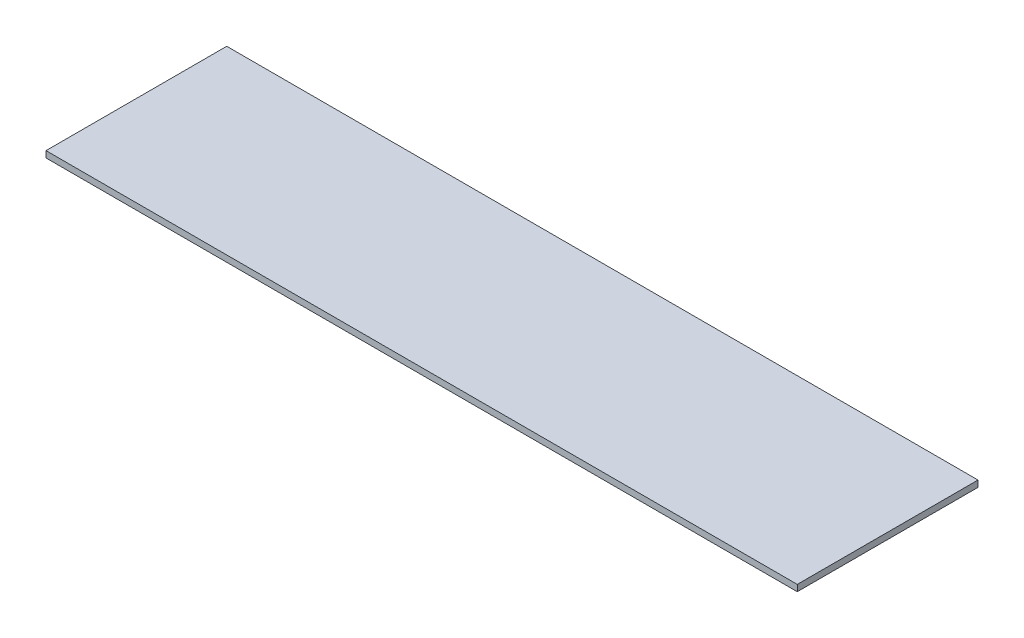
ISO-10303-21;
HEADER;
FILE_DESCRIPTION(('STEP AP214'),'2;1');
FILE_NAME('part.step','',(''),(''),'','','');
FILE_SCHEMA(('AUTOMOTIVE_DESIGN { 1 0 10303 214 1 1 1 1 }'));
ENDSEC;
DATA;
#1=APPLICATION_CONTEXT('core data for automotive mechanical design processes');
#2=APPLICATION_PROTOCOL_DEFINITION('international standard','automotive_design',2000,#1);
#3=PRODUCT_CONTEXT('',#1,'mechanical');
#4=PRODUCT('Part','Part','',(#3));
#5=PRODUCT_RELATED_PRODUCT_CATEGORY('part','',(#4));
#6=PRODUCT_DEFINITION_FORMATION('','',#4);
#7=PRODUCT_DEFINITION_CONTEXT('part definition',#1,'design');
#8=PRODUCT_DEFINITION('design','',#6,#7);
#9=PRODUCT_DEFINITION_SHAPE('','',#8);
#10=(LENGTH_UNIT() NAMED_UNIT(*) SI_UNIT(.MILLI.,.METRE.));
#11=(NAMED_UNIT(*) PLANE_ANGLE_UNIT() SI_UNIT($,.RADIAN.));
#12=(NAMED_UNIT(*) SI_UNIT($,.STERADIAN.) SOLID_ANGLE_UNIT());
#13=UNCERTAINTY_MEASURE_WITH_UNIT(LENGTH_MEASURE(1.E-05),#10,'distance_accuracy_value','');
#14=(GEOMETRIC_REPRESENTATION_CONTEXT(3) GLOBAL_UNCERTAINTY_ASSIGNED_CONTEXT((#13)) GLOBAL_UNIT_ASSIGNED_CONTEXT((#10,
#11,#12)) REPRESENTATION_CONTEXT('',''));
#15=CARTESIAN_POINT('',(0.,0.,0.));
#16=DIRECTION('',(0.,0.,1.));
#17=DIRECTION('',(1.,0.,0.));
#18=AXIS2_PLACEMENT_3D('',#15,#16,#17);
#19=CARTESIAN_POINT('',(0.,18.,0.));
#20=DIRECTION('',(1.,0.,0.));
#21=DIRECTION('',(0.,0.,-1.));
#22=AXIS2_PLACEMENT_3D('',#19,#20,#21);
#23=PLANE('',#22);
#24=DIRECTION('',(0.,0.,1.));
#25=VECTOR('',#24,1.);
#26=CARTESIAN_POINT('',(0.,0.,0.));
#27=LINE('',#26,#25);
#28=CARTESIAN_POINT('',(0.,0.,-510.));
#29=VERTEX_POINT('',#28);
#30=CARTESIAN_POINT('',(0.,0.,0.));
#31=VERTEX_POINT('',#30);
#32=EDGE_CURVE('E96',#29,#31,#27,.T.);
#33=ORIENTED_EDGE('',*,*,#32,.T.);
#34=DIRECTION('',(0.,-1.,0.));
#35=VECTOR('',#34,1.);
#36=CARTESIAN_POINT('',(0.,18.,0.));
#37=LINE('',#36,#35);
#38=CARTESIAN_POINT('',(0.,18.,0.));
#39=VERTEX_POINT('',#38);
#40=EDGE_CURVE('E11',#39,#31,#37,.T.);
#41=ORIENTED_EDGE('',*,*,#40,.F.);
#42=DIRECTION('',(0.,0.,1.));
#43=VECTOR('',#42,1.);
#44=CARTESIAN_POINT('',(0.,18.,0.));
#45=LINE('',#44,#43);
#46=CARTESIAN_POINT('',(0.,18.,-510.));
#47=VERTEX_POINT('',#46);
#48=EDGE_CURVE('E84',#47,#39,#45,.T.);
#49=ORIENTED_EDGE('',*,*,#48,.F.);
#50=DIRECTION('',(0.,-1.,0.));
#51=VECTOR('',#50,1.);
#52=CARTESIAN_POINT('',(0.,18.,-510.));
#53=LINE('',#52,#51);
#54=EDGE_CURVE('E92',#47,#29,#53,.T.);
#55=ORIENTED_EDGE('',*,*,#54,.T.);
#56=EDGE_LOOP('',(#33,#41,#49,#55));
#57=FACE_BOUND('',#56,.T.);
#58=ADVANCED_FACE('F33',(#57),#23,.F.);
#59=CARTESIAN_POINT('',(0.,18.,0.));
#60=DIRECTION('',(0.,0.,-1.));
#61=DIRECTION('',(-1.,0.,0.));
#62=AXIS2_PLACEMENT_3D('',#59,#60,#61);
#63=PLANE('',#62);
#64=DIRECTION('',(1.,0.,0.));
#65=VECTOR('',#64,1.);
#66=CARTESIAN_POINT('',(0.,0.,0.));
#67=LINE('',#66,#65);
#68=CARTESIAN_POINT('',(2120.,0.,0.));
#69=VERTEX_POINT('',#68);
#70=EDGE_CURVE('E88',#31,#69,#67,.T.);
#71=ORIENTED_EDGE('',*,*,#70,.T.);
#72=DIRECTION('',(0.,-1.,0.));
#73=VECTOR('',#72,1.);
#74=CARTESIAN_POINT('',(2120.,18.,0.));
#75=LINE('',#74,#73);
#76=CARTESIAN_POINT('',(2120.,18.,0.));
#77=VERTEX_POINT('',#76);
#78=EDGE_CURVE('E41',#77,#69,#75,.T.);
#79=ORIENTED_EDGE('',*,*,#78,.F.);
#80=DIRECTION('',(1.,0.,0.));
#81=VECTOR('',#80,1.);
#82=CARTESIAN_POINT('',(0.,18.,0.));
#83=LINE('',#82,#81);
#84=EDGE_CURVE('E79',#39,#77,#83,.T.);
#85=ORIENTED_EDGE('',*,*,#84,.F.);
#86=ORIENTED_EDGE('',*,*,#40,.T.);
#87=EDGE_LOOP('',(#71,#79,#85,#86));
#88=FACE_BOUND('',#87,.T.);
#89=ADVANCED_FACE('F87',(#88),#63,.F.);
#90=CARTESIAN_POINT('',(2120.,18.,0.));
#91=DIRECTION('',(-1.,0.,0.));
#92=DIRECTION('',(0.,0.,1.));
#93=AXIS2_PLACEMENT_3D('',#90,#91,#92);
#94=PLANE('',#93);
#95=DIRECTION('',(0.,0.,-1.));
#96=VECTOR('',#95,1.);
#97=CARTESIAN_POINT('',(2120.,0.,0.));
#98=LINE('',#97,#96);
#99=CARTESIAN_POINT('',(2120.,0.,-510.));
#100=VERTEX_POINT('',#99);
#101=EDGE_CURVE('E66',#69,#100,#98,.T.);
#102=ORIENTED_EDGE('',*,*,#101,.T.);
#103=DIRECTION('',(0.,-1.,0.));
#104=VECTOR('',#103,1.);
#105=CARTESIAN_POINT('',(2120.,18.,-510.));
#106=LINE('',#105,#104);
#107=CARTESIAN_POINT('',(2120.,18.,-510.));
#108=VERTEX_POINT('',#107);
#109=EDGE_CURVE('E89',#108,#100,#106,.T.);
#110=ORIENTED_EDGE('',*,*,#109,.F.);
#111=DIRECTION('',(0.,0.,-1.));
#112=VECTOR('',#111,1.);
#113=CARTESIAN_POINT('',(2120.,18.,0.));
#114=LINE('',#113,#112);
#115=EDGE_CURVE('E82',#77,#108,#114,.T.);
#116=ORIENTED_EDGE('',*,*,#115,.F.);
#117=ORIENTED_EDGE('',*,*,#78,.T.);
#118=EDGE_LOOP('',(#102,#110,#116,#117));
#119=FACE_BOUND('',#118,.T.);
#120=ADVANCED_FACE('F90',(#119),#94,.F.);
#121=CARTESIAN_POINT('',(0.,18.,-510.));
#122=DIRECTION('',(0.,0.,1.));
#123=DIRECTION('',(1.,0.,0.));
#124=AXIS2_PLACEMENT_3D('',#121,#122,#123);
#125=PLANE('',#124);
#126=DIRECTION('',(-1.,0.,0.));
#127=VECTOR('',#126,1.);
#128=CARTESIAN_POINT('',(0.,0.,-510.));
#129=LINE('',#128,#127);
#130=EDGE_CURVE('E72',#100,#29,#129,.T.);
#131=ORIENTED_EDGE('',*,*,#130,.T.);
#132=ORIENTED_EDGE('',*,*,#54,.F.);
#133=DIRECTION('',(-1.,0.,0.));
#134=VECTOR('',#133,1.);
#135=CARTESIAN_POINT('',(0.,18.,-510.));
#136=LINE('',#135,#134);
#137=EDGE_CURVE('E49',#108,#47,#136,.T.);
#138=ORIENTED_EDGE('',*,*,#137,.F.);
#139=ORIENTED_EDGE('',*,*,#109,.T.);
#140=EDGE_LOOP('',(#131,#132,#138,#139));
#141=FACE_BOUND('',#140,.T.);
#142=ADVANCED_FACE('F103',(#141),#125,.F.);
#143=CARTESIAN_POINT('',(0.,18.,0.));
#144=DIRECTION('',(0.,-1.,0.));
#145=DIRECTION('',(0.,0.,-1.));
#146=AXIS2_PLACEMENT_3D('',#143,#144,#145);
#147=PLANE('',#146);
#148=ORIENTED_EDGE('',*,*,#48,.T.);
#149=ORIENTED_EDGE('',*,*,#84,.T.);
#150=ORIENTED_EDGE('',*,*,#115,.T.);
#151=ORIENTED_EDGE('',*,*,#137,.T.);
#152=EDGE_LOOP('',(#148,#149,#150,#151));
#153=FACE_BOUND('',#152,.T.);
#154=ADVANCED_FACE('F80',(#153),#147,.F.);
#155=CARTESIAN_POINT('',(0.,0.,0.));
#156=DIRECTION('',(0.,-1.,0.));
#157=DIRECTION('',(0.,0.,-1.));
#158=AXIS2_PLACEMENT_3D('',#155,#156,#157);
#159=PLANE('',#158);
#160=ORIENTED_EDGE('',*,*,#32,.F.);
#161=ORIENTED_EDGE('',*,*,#130,.F.);
#162=ORIENTED_EDGE('',*,*,#101,.F.);
#163=ORIENTED_EDGE('',*,*,#70,.F.);
#164=EDGE_LOOP('',(#160,#161,#162,#163));
#165=FACE_BOUND('',#164,.T.);
#166=ADVANCED_FACE('F106',(#165),#159,.T.);
#167=CLOSED_SHELL('',(#58,#89,#120,#142,#154,#166));
#168=MANIFOLD_SOLID_BREP('B2',#167);
#169=ADVANCED_BREP_SHAPE_REPRESENTATION('',(#18,#168),#14);
#170=SHAPE_DEFINITION_REPRESENTATION(#9,#169);
ENDSEC;
END-ISO-10303-21;
